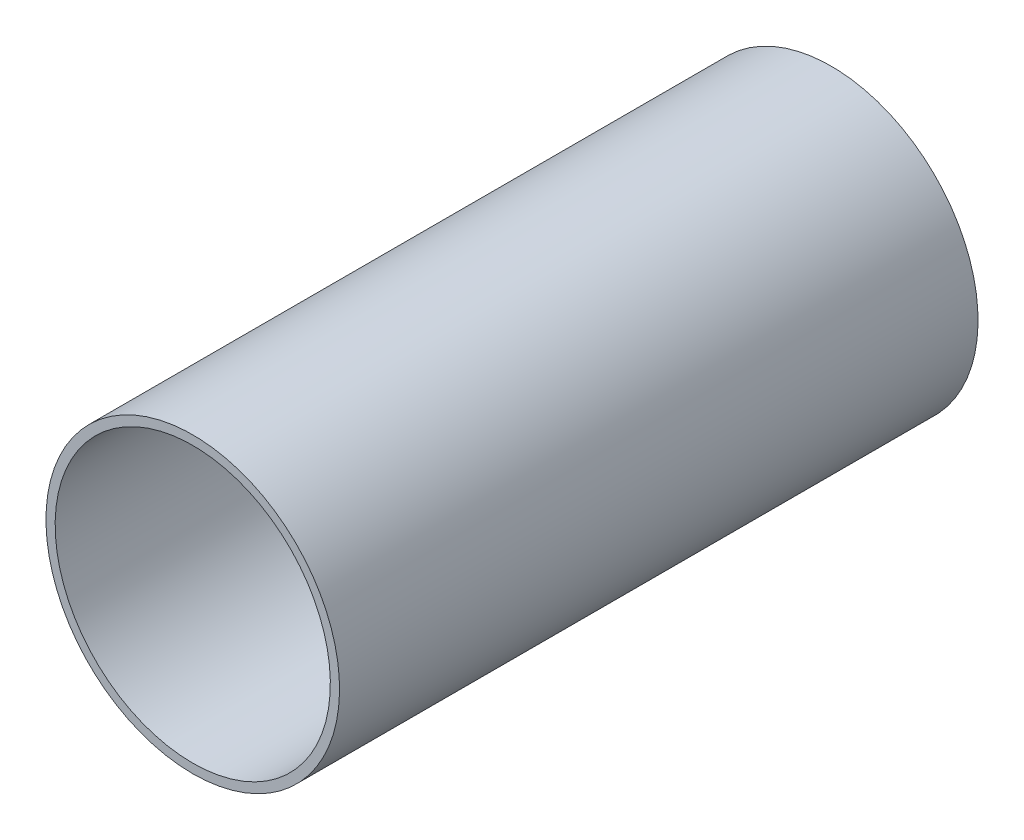
ISO-10303-21;
HEADER;
FILE_DESCRIPTION(('STEP AP214'),'2;1');
FILE_NAME('part.step','',(''),(''),'','','');
FILE_SCHEMA(('AUTOMOTIVE_DESIGN { 1 0 10303 214 1 1 1 1 }'));
ENDSEC;
DATA;
#1=APPLICATION_CONTEXT('core data for automotive mechanical design processes');
#2=APPLICATION_PROTOCOL_DEFINITION('international standard','automotive_design',2000,#1);
#3=PRODUCT_CONTEXT('',#1,'mechanical');
#4=PRODUCT('Part','Part','',(#3));
#5=PRODUCT_RELATED_PRODUCT_CATEGORY('part','',(#4));
#6=PRODUCT_DEFINITION_FORMATION('','',#4);
#7=PRODUCT_DEFINITION_CONTEXT('part definition',#1,'design');
#8=PRODUCT_DEFINITION('design','',#6,#7);
#9=PRODUCT_DEFINITION_SHAPE('','',#8);
#10=(LENGTH_UNIT() NAMED_UNIT(*) SI_UNIT(.MILLI.,.METRE.));
#11=(NAMED_UNIT(*) PLANE_ANGLE_UNIT() SI_UNIT($,.RADIAN.));
#12=(NAMED_UNIT(*) SI_UNIT($,.STERADIAN.) SOLID_ANGLE_UNIT());
#13=UNCERTAINTY_MEASURE_WITH_UNIT(LENGTH_MEASURE(1.E-05),#10,'distance_accuracy_value','');
#14=(GEOMETRIC_REPRESENTATION_CONTEXT(3) GLOBAL_UNCERTAINTY_ASSIGNED_CONTEXT((#13)) GLOBAL_UNIT_ASSIGNED_CONTEXT((#10,
#11,#12)) REPRESENTATION_CONTEXT('',''));
#15=CARTESIAN_POINT('',(0.,0.,0.));
#16=DIRECTION('',(0.,0.,1.));
#17=DIRECTION('',(1.,0.,0.));
#18=AXIS2_PLACEMENT_3D('',#15,#16,#17);
#19=CARTESIAN_POINT('',(155.448,-76.2,-0.045));
#20=DIRECTION('',(0.,0.,-1.));
#21=DIRECTION('',(0.,-1.,0.));
#22=AXIS2_PLACEMENT_3D('',#19,#20,#21);
#23=CYLINDRICAL_SURFACE('',#22,0.375);
#24=CARTESIAN_POINT('',(155.448,-76.2,-0.035));
#25=DIRECTION('',(0.,0.,-1.));
#26=DIRECTION('',(0.,-1.,0.));
#27=AXIS2_PLACEMENT_3D('',#24,#25,#26);
#28=CIRCLE('',#27,0.375);
#29=CARTESIAN_POINT('',(155.448,-76.575,-0.035));
#30=VERTEX_POINT('',#29);
#31=EDGE_CURVE('E64',#30,#30,#28,.T.);
#32=ORIENTED_EDGE('',*,*,#31,.T.);
#33=DIRECTION('',(0.,0.,1.));
#34=VECTOR('',#33,1.);
#35=CARTESIAN_POINT('',(155.448,-76.575,-0.045));
#36=LINE('',#35,#34);
#37=CARTESIAN_POINT('',(155.448,-76.575,1.705));
#38=VERTEX_POINT('',#37);
#39=EDGE_CURVE('E11',#30,#38,#36,.T.);
#40=ORIENTED_EDGE('',*,*,#39,.T.);
#41=CARTESIAN_POINT('',(155.448,-76.2,1.705));
#42=DIRECTION('',(0.,0.,-1.));
#43=DIRECTION('',(0.,-1.,0.));
#44=AXIS2_PLACEMENT_3D('',#41,#42,#43);
#45=CIRCLE('',#44,0.375);
#46=EDGE_CURVE('E25',#38,#38,#45,.T.);
#47=ORIENTED_EDGE('',*,*,#46,.F.);
#48=ORIENTED_EDGE('',*,*,#39,.F.);
#49=EDGE_LOOP('',(#32,#40,#47,#48));
#50=FACE_BOUND('',#49,.T.);
#51=ADVANCED_FACE('F17',(#50),#23,.F.);
#52=CARTESIAN_POINT('',(155.448,-76.6,1.705));
#53=DIRECTION('',(0.,0.,1.));
#54=DIRECTION('',(1.,0.,0.));
#55=AXIS2_PLACEMENT_3D('',#52,#53,#54);
#56=PLANE('',#55);
#57=ORIENTED_EDGE('',*,*,#46,.T.);
#58=EDGE_LOOP('',(#57));
#59=FACE_BOUND('',#58,.T.);
#60=CARTESIAN_POINT('',(155.448,-76.2,1.705));
#61=DIRECTION('',(0.,0.,1.));
#62=DIRECTION('',(0.,-1.,0.));
#63=AXIS2_PLACEMENT_3D('',#60,#61,#62);
#64=CIRCLE('',#63,0.4);
#65=CARTESIAN_POINT('',(155.448,-76.6,1.705));
#66=VERTEX_POINT('',#65);
#67=EDGE_CURVE('E56',#66,#66,#64,.T.);
#68=ORIENTED_EDGE('',*,*,#67,.T.);
#69=EDGE_LOOP('',(#68));
#70=FACE_BOUND('',#69,.T.);
#71=ADVANCED_FACE('F73',(#59,#70),#56,.T.);
#72=CARTESIAN_POINT('',(155.448,-76.6,-0.035));
#73=DIRECTION('',(0.,0.,1.));
#74=DIRECTION('',(1.,0.,0.));
#75=AXIS2_PLACEMENT_3D('',#72,#73,#74);
#76=PLANE('',#75);
#77=ORIENTED_EDGE('',*,*,#31,.F.);
#78=EDGE_LOOP('',(#77));
#79=FACE_BOUND('',#78,.T.);
#80=CARTESIAN_POINT('',(155.448,-76.2,-0.035));
#81=DIRECTION('',(0.,0.,1.));
#82=DIRECTION('',(0.,-1.,0.));
#83=AXIS2_PLACEMENT_3D('',#80,#81,#82);
#84=CIRCLE('',#83,0.4);
#85=CARTESIAN_POINT('',(155.448,-76.6,-0.035));
#86=VERTEX_POINT('',#85);
#87=EDGE_CURVE('E55',#86,#86,#84,.T.);
#88=ORIENTED_EDGE('',*,*,#87,.F.);
#89=EDGE_LOOP('',(#88));
#90=FACE_BOUND('',#89,.T.);
#91=ADVANCED_FACE('F82',(#79,#90),#76,.F.);
#92=CARTESIAN_POINT('',(155.448,-76.2,-0.035));
#93=DIRECTION('',(0.,0.,-1.));
#94=DIRECTION('',(0.,-1.,0.));
#95=AXIS2_PLACEMENT_3D('',#92,#93,#94);
#96=CYLINDRICAL_SURFACE('',#95,0.4);
#97=ORIENTED_EDGE('',*,*,#87,.T.);
#98=DIRECTION('',(0.,0.,1.));
#99=VECTOR('',#98,1.);
#100=CARTESIAN_POINT('',(155.448,-76.6,-0.035));
#101=LINE('',#100,#99);
#102=EDGE_CURVE('E52',#86,#66,#101,.T.);
#103=ORIENTED_EDGE('',*,*,#102,.T.);
#104=ORIENTED_EDGE('',*,*,#67,.F.);
#105=ORIENTED_EDGE('',*,*,#102,.F.);
#106=EDGE_LOOP('',(#97,#103,#104,#105));
#107=FACE_BOUND('',#106,.T.);
#108=ADVANCED_FACE('F53',(#107),#96,.T.);
#109=CLOSED_SHELL('',(#51,#71,#91,#108));
#110=MANIFOLD_SOLID_BREP('B1',#109);
#111=ADVANCED_BREP_SHAPE_REPRESENTATION('',(#18,#110),#14);
#112=SHAPE_DEFINITION_REPRESENTATION(#9,#111);
ENDSEC;
END-ISO-10303-21;
